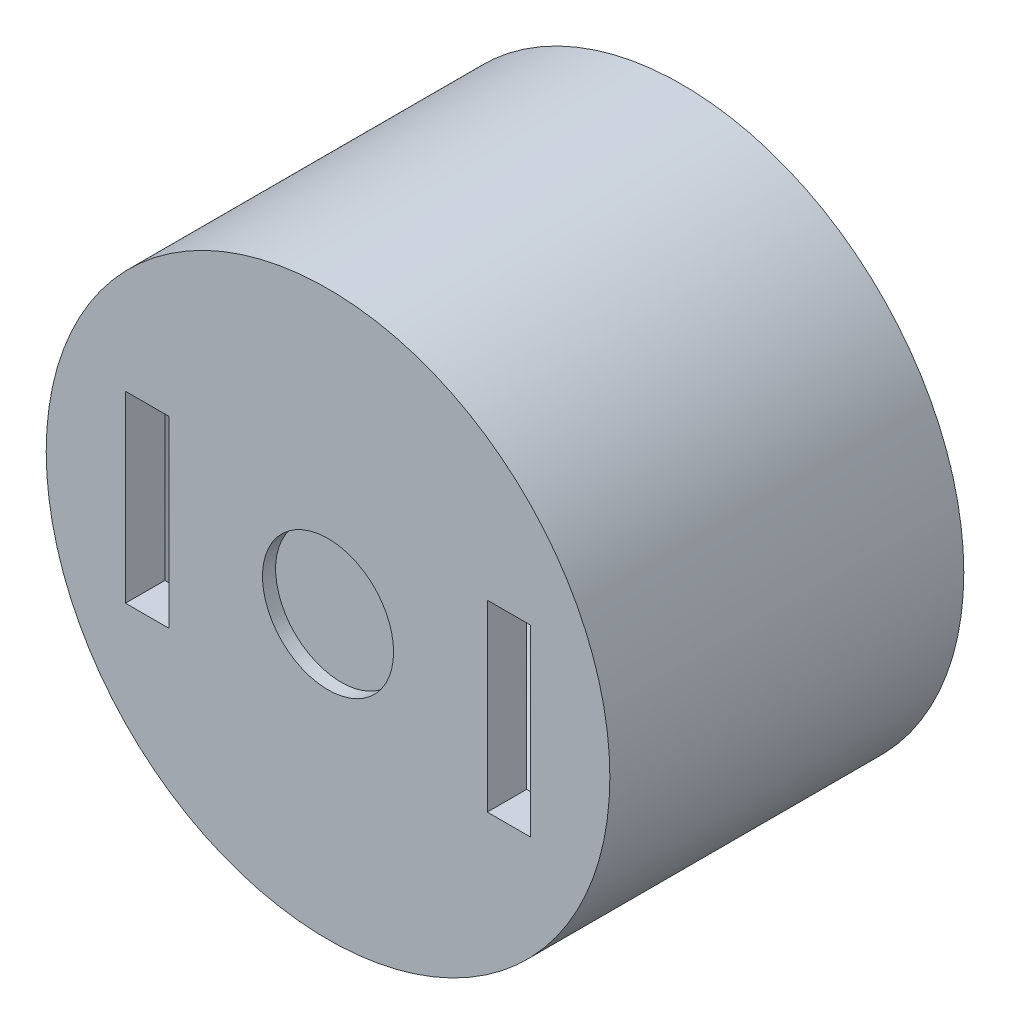
ISO-10303-21;
HEADER;
FILE_DESCRIPTION(('STEP AP214'),'2;1');
FILE_NAME('part.step','',(''),(''),'','','');
FILE_SCHEMA(('AUTOMOTIVE_DESIGN { 1 0 10303 214 1 1 1 1 }'));
ENDSEC;
DATA;
#1=APPLICATION_CONTEXT('core data for automotive mechanical design processes');
#2=APPLICATION_PROTOCOL_DEFINITION('international standard','automotive_design',2000,#1);
#3=PRODUCT_CONTEXT('',#1,'mechanical');
#4=PRODUCT('Part','Part','',(#3));
#5=PRODUCT_RELATED_PRODUCT_CATEGORY('part','',(#4));
#6=PRODUCT_DEFINITION_FORMATION('','',#4);
#7=PRODUCT_DEFINITION_CONTEXT('part definition',#1,'design');
#8=PRODUCT_DEFINITION('design','',#6,#7);
#9=PRODUCT_DEFINITION_SHAPE('','',#8);
#10=(LENGTH_UNIT() NAMED_UNIT(*) SI_UNIT(.MILLI.,.METRE.));
#11=(NAMED_UNIT(*) PLANE_ANGLE_UNIT() SI_UNIT($,.RADIAN.));
#12=(NAMED_UNIT(*) SI_UNIT($,.STERADIAN.) SOLID_ANGLE_UNIT());
#13=UNCERTAINTY_MEASURE_WITH_UNIT(LENGTH_MEASURE(1.E-05),#10,'distance_accuracy_value','');
#14=(GEOMETRIC_REPRESENTATION_CONTEXT(3) GLOBAL_UNCERTAINTY_ASSIGNED_CONTEXT((#13)) GLOBAL_UNIT_ASSIGNED_CONTEXT((#10,
#11,#12)) REPRESENTATION_CONTEXT('',''));
#15=CARTESIAN_POINT('',(0.,0.,0.));
#16=DIRECTION('',(0.,0.,1.));
#17=DIRECTION('',(1.,0.,0.));
#18=AXIS2_PLACEMENT_3D('',#15,#16,#17);
#19=CARTESIAN_POINT('',(0.,0.,27.));
#20=DIRECTION('',(0.,0.,1.));
#21=DIRECTION('',(1.,0.,0.));
#22=AXIS2_PLACEMENT_3D('',#19,#20,#21);
#23=PLANE('',#22);
#24=CARTESIAN_POINT('',(0.,0.,27.));
#25=DIRECTION('',(0.,0.,1.));
#26=DIRECTION('',(1.,0.,0.));
#27=AXIS2_PLACEMENT_3D('',#24,#25,#26);
#28=CIRCLE('',#27,5.);
#29=CARTESIAN_POINT('',(5.,0.,27.));
#30=VERTEX_POINT('',#29);
#31=EDGE_CURVE('E257',#30,#30,#28,.T.);
#32=ORIENTED_EDGE('',*,*,#31,.F.);
#33=EDGE_LOOP('',(#32));
#34=FACE_BOUND('',#33,.T.);
#35=CARTESIAN_POINT('',(0.,0.,27.));
#36=DIRECTION('',(0.,0.,1.));
#37=DIRECTION('',(1.,0.,0.));
#38=AXIS2_PLACEMENT_3D('',#35,#36,#37);
#39=CIRCLE('',#38,21.5);
#40=CARTESIAN_POINT('',(21.5,0.,27.));
#41=VERTEX_POINT('',#40);
#42=EDGE_CURVE('E147',#41,#41,#39,.T.);
#43=ORIENTED_EDGE('',*,*,#42,.T.);
#44=EDGE_LOOP('',(#43));
#45=FACE_BOUND('',#44,.T.);
#46=DIRECTION('',(1.,0.,0.));
#47=VECTOR('',#46,1.);
#48=CARTESIAN_POINT('',(0.,7.00000000000001,27.));
#49=LINE('',#48,#47);
#50=CARTESIAN_POINT('',(-15.45,7.,27.));
#51=VERTEX_POINT('',#50);
#52=CARTESIAN_POINT('',(-12.15,7.,27.));
#53=VERTEX_POINT('',#52);
#54=EDGE_CURVE('E123',#51,#53,#49,.T.);
#55=ORIENTED_EDGE('',*,*,#54,.T.);
#56=DIRECTION('',(0.,-1.,0.));
#57=VECTOR('',#56,1.);
#58=CARTESIAN_POINT('',(-12.15,0.,27.));
#59=LINE('',#58,#57);
#60=CARTESIAN_POINT('',(-12.15,-7.,27.));
#61=VERTEX_POINT('',#60);
#62=EDGE_CURVE('E114',#53,#61,#59,.T.);
#63=ORIENTED_EDGE('',*,*,#62,.T.);
#64=DIRECTION('',(-1.,0.,0.));
#65=VECTOR('',#64,1.);
#66=CARTESIAN_POINT('',(0.,-7.,27.));
#67=LINE('',#66,#65);
#68=CARTESIAN_POINT('',(-15.45,-7.,27.));
#69=VERTEX_POINT('',#68);
#70=EDGE_CURVE('E100',#61,#69,#67,.T.);
#71=ORIENTED_EDGE('',*,*,#70,.T.);
#72=DIRECTION('',(0.,1.,0.));
#73=VECTOR('',#72,1.);
#74=CARTESIAN_POINT('',(-15.45,0.,27.));
#75=LINE('',#74,#73);
#76=EDGE_CURVE('E108',#69,#51,#75,.T.);
#77=ORIENTED_EDGE('',*,*,#76,.T.);
#78=EDGE_LOOP('',(#55,#63,#71,#77));
#79=FACE_BOUND('',#78,.T.);
#80=DIRECTION('',(-1.,0.,0.));
#81=VECTOR('',#80,1.);
#82=CARTESIAN_POINT('',(0.,-7.00000000000001,27.));
#83=LINE('',#82,#81);
#84=CARTESIAN_POINT('',(15.45,-7.,27.));
#85=VERTEX_POINT('',#84);
#86=CARTESIAN_POINT('',(12.15,-7.,27.));
#87=VERTEX_POINT('',#86);
#88=EDGE_CURVE('E134',#85,#87,#83,.T.);
#89=ORIENTED_EDGE('',*,*,#88,.T.);
#90=DIRECTION('',(0.,1.,0.));
#91=VECTOR('',#90,1.);
#92=CARTESIAN_POINT('',(12.15,0.,27.));
#93=LINE('',#92,#91);
#94=CARTESIAN_POINT('',(12.15,7.,27.));
#95=VERTEX_POINT('',#94);
#96=EDGE_CURVE('E137',#87,#95,#93,.T.);
#97=ORIENTED_EDGE('',*,*,#96,.T.);
#98=DIRECTION('',(1.,0.,0.));
#99=VECTOR('',#98,1.);
#100=CARTESIAN_POINT('',(0.,7.00000000000001,27.));
#101=LINE('',#100,#99);
#102=CARTESIAN_POINT('',(15.45,7.,27.));
#103=VERTEX_POINT('',#102);
#104=EDGE_CURVE('E124',#95,#103,#101,.T.);
#105=ORIENTED_EDGE('',*,*,#104,.T.);
#106=DIRECTION('',(0.,-1.,0.));
#107=VECTOR('',#106,1.);
#108=CARTESIAN_POINT('',(15.45,0.,27.));
#109=LINE('',#108,#107);
#110=EDGE_CURVE('E127',#103,#85,#109,.T.);
#111=ORIENTED_EDGE('',*,*,#110,.T.);
#112=EDGE_LOOP('',(#89,#97,#105,#111));
#113=FACE_BOUND('',#112,.T.);
#114=ADVANCED_FACE('F37',(#34,#45,#79,#113),#23,.T.);
#115=CARTESIAN_POINT('',(0.,0.,24.));
#116=DIRECTION('',(0.,0.,1.));
#117=DIRECTION('',(1.,0.,0.));
#118=AXIS2_PLACEMENT_3D('',#115,#116,#117);
#119=PLANE('',#118);
#120=DIRECTION('',(0.,-1.,0.));
#121=VECTOR('',#120,1.);
#122=CARTESIAN_POINT('',(-12.15,0.,24.));
#123=LINE('',#122,#121);
#124=CARTESIAN_POINT('',(-12.15,7.,24.));
#125=VERTEX_POINT('',#124);
#126=CARTESIAN_POINT('',(-12.15,-7.,24.));
#127=VERTEX_POINT('',#126);
#128=EDGE_CURVE('E117',#125,#127,#123,.T.);
#129=ORIENTED_EDGE('',*,*,#128,.F.);
#130=DIRECTION('',(1.,0.,0.));
#131=VECTOR('',#130,1.);
#132=CARTESIAN_POINT('',(0.,7.00000000000001,24.));
#133=LINE('',#132,#131);
#134=CARTESIAN_POINT('',(-15.45,7.,24.));
#135=VERTEX_POINT('',#134);
#136=EDGE_CURVE('E156',#135,#125,#133,.T.);
#137=ORIENTED_EDGE('',*,*,#136,.F.);
#138=DIRECTION('',(0.,1.,0.));
#139=VECTOR('',#138,1.);
#140=CARTESIAN_POINT('',(-15.45,0.,24.));
#141=LINE('',#140,#139);
#142=CARTESIAN_POINT('',(-15.45,-7.,24.));
#143=VERTEX_POINT('',#142);
#144=EDGE_CURVE('E154',#143,#135,#141,.T.);
#145=ORIENTED_EDGE('',*,*,#144,.F.);
#146=DIRECTION('',(-1.,0.,0.));
#147=VECTOR('',#146,1.);
#148=CARTESIAN_POINT('',(0.,-7.,24.));
#149=LINE('',#148,#147);
#150=EDGE_CURVE('E150',#127,#143,#149,.T.);
#151=ORIENTED_EDGE('',*,*,#150,.F.);
#152=EDGE_LOOP('',(#129,#137,#145,#151));
#153=FACE_BOUND('',#152,.T.);
#154=CARTESIAN_POINT('',(0.,0.,24.));
#155=DIRECTION('',(0.,0.,1.));
#156=DIRECTION('',(1.,0.,0.));
#157=AXIS2_PLACEMENT_3D('',#154,#155,#156);
#158=CIRCLE('',#157,18.75);
#159=CARTESIAN_POINT('',(18.75,0.,24.));
#160=VERTEX_POINT('',#159);
#161=EDGE_CURVE('E141',#160,#160,#158,.T.);
#162=ORIENTED_EDGE('',*,*,#161,.F.);
#163=EDGE_LOOP('',(#162));
#164=FACE_BOUND('',#163,.T.);
#165=DIRECTION('',(0.,1.,0.));
#166=VECTOR('',#165,1.);
#167=CARTESIAN_POINT('',(12.15,0.,24.));
#168=LINE('',#167,#166);
#169=CARTESIAN_POINT('',(12.15,-7.,24.));
#170=VERTEX_POINT('',#169);
#171=CARTESIAN_POINT('',(12.15,7.,24.));
#172=VERTEX_POINT('',#171);
#173=EDGE_CURVE('E11',#170,#172,#168,.T.);
#174=ORIENTED_EDGE('',*,*,#173,.F.);
#175=DIRECTION('',(-1.,0.,0.));
#176=VECTOR('',#175,1.);
#177=CARTESIAN_POINT('',(0.,-7.00000000000001,24.));
#178=LINE('',#177,#176);
#179=CARTESIAN_POINT('',(15.45,-7.,24.));
#180=VERTEX_POINT('',#179);
#181=EDGE_CURVE('E45',#180,#170,#178,.T.);
#182=ORIENTED_EDGE('',*,*,#181,.F.);
#183=DIRECTION('',(0.,-1.,0.));
#184=VECTOR('',#183,1.);
#185=CARTESIAN_POINT('',(15.45,0.,24.));
#186=LINE('',#185,#184);
#187=CARTESIAN_POINT('',(15.45,7.,24.));
#188=VERTEX_POINT('',#187);
#189=EDGE_CURVE('E161',#188,#180,#186,.T.);
#190=ORIENTED_EDGE('',*,*,#189,.F.);
#191=DIRECTION('',(1.,0.,0.));
#192=VECTOR('',#191,1.);
#193=CARTESIAN_POINT('',(0.,7.00000000000001,24.));
#194=LINE('',#193,#192);
#195=EDGE_CURVE('E159',#172,#188,#194,.T.);
#196=ORIENTED_EDGE('',*,*,#195,.F.);
#197=EDGE_LOOP('',(#174,#182,#190,#196));
#198=FACE_BOUND('',#197,.T.);
#199=ADVANCED_FACE('F178',(#153,#164,#198),#119,.F.);
#200=CARTESIAN_POINT('',(0.,0.,27.));
#201=DIRECTION('',(0.,0.,-1.));
#202=DIRECTION('',(-1.,0.,0.));
#203=AXIS2_PLACEMENT_3D('',#200,#201,#202);
#204=CYLINDRICAL_SURFACE('',#203,21.5);
#205=ORIENTED_EDGE('',*,*,#42,.F.);
#206=EDGE_LOOP('',(#205));
#207=FACE_BOUND('',#206,.T.);
#208=CARTESIAN_POINT('',(0.,0.,0.));
#209=DIRECTION('',(0.,0.,1.));
#210=DIRECTION('',(1.,0.,0.));
#211=AXIS2_PLACEMENT_3D('',#208,#209,#210);
#212=CIRCLE('',#211,21.5);
#213=CARTESIAN_POINT('',(21.5,0.,0.));
#214=VERTEX_POINT('',#213);
#215=EDGE_CURVE('E144',#214,#214,#212,.T.);
#216=ORIENTED_EDGE('',*,*,#215,.T.);
#217=EDGE_LOOP('',(#216));
#218=FACE_BOUND('',#217,.T.);
#219=ADVANCED_FACE('F39',(#207,#218),#204,.T.);
#220=CARTESIAN_POINT('',(0.,0.,0.));
#221=DIRECTION('',(0.,0.,1.));
#222=DIRECTION('',(1.,0.,0.));
#223=AXIS2_PLACEMENT_3D('',#220,#221,#222);
#224=PLANE('',#223);
#225=CARTESIAN_POINT('',(0.,0.,0.));
#226=DIRECTION('',(0.,0.,1.));
#227=DIRECTION('',(1.,0.,0.));
#228=AXIS2_PLACEMENT_3D('',#225,#226,#227);
#229=CIRCLE('',#228,18.75);
#230=CARTESIAN_POINT('',(18.75,0.,0.));
#231=VERTEX_POINT('',#230);
#232=EDGE_CURVE('E140',#231,#231,#229,.T.);
#233=ORIENTED_EDGE('',*,*,#232,.T.);
#234=EDGE_LOOP('',(#233));
#235=FACE_BOUND('',#234,.T.);
#236=ORIENTED_EDGE('',*,*,#215,.F.);
#237=EDGE_LOOP('',(#236));
#238=FACE_BOUND('',#237,.T.);
#239=ADVANCED_FACE('F209',(#235,#238),#224,.F.);
#240=CARTESIAN_POINT('',(0.,0.,24.));
#241=DIRECTION('',(0.,0.,-1.));
#242=DIRECTION('',(-1.,0.,0.));
#243=AXIS2_PLACEMENT_3D('',#240,#241,#242);
#244=CYLINDRICAL_SURFACE('',#243,18.75);
#245=ORIENTED_EDGE('',*,*,#161,.T.);
#246=EDGE_LOOP('',(#245));
#247=FACE_BOUND('',#246,.T.);
#248=ORIENTED_EDGE('',*,*,#232,.F.);
#249=EDGE_LOOP('',(#248));
#250=FACE_BOUND('',#249,.T.);
#251=ADVANCED_FACE('F206',(#247,#250),#244,.F.);
#252=CARTESIAN_POINT('',(-12.15,7.,32.));
#253=DIRECTION('',(-1.,0.,0.));
#254=DIRECTION('',(0.,-1.,0.));
#255=AXIS2_PLACEMENT_3D('',#252,#253,#254);
#256=PLANE('',#255);
#257=DIRECTION('',(0.,0.,-1.));
#258=VECTOR('',#257,1.);
#259=CARTESIAN_POINT('',(-12.15,7.,32.));
#260=LINE('',#259,#258);
#261=EDGE_CURVE('E185',#53,#125,#260,.T.);
#262=ORIENTED_EDGE('',*,*,#261,.T.);
#263=ORIENTED_EDGE('',*,*,#128,.T.);
#264=DIRECTION('',(0.,0.,-1.));
#265=VECTOR('',#264,1.);
#266=CARTESIAN_POINT('',(-12.15,-7.,32.));
#267=LINE('',#266,#265);
#268=EDGE_CURVE('E103',#61,#127,#267,.T.);
#269=ORIENTED_EDGE('',*,*,#268,.F.);
#270=ORIENTED_EDGE('',*,*,#62,.F.);
#271=EDGE_LOOP('',(#262,#263,#269,#270));
#272=FACE_BOUND('',#271,.T.);
#273=ADVANCED_FACE('F113',(#272),#256,.T.);
#274=CARTESIAN_POINT('',(-15.45,7.,32.));
#275=DIRECTION('',(0.,-1.,0.));
#276=DIRECTION('',(1.,0.,0.));
#277=AXIS2_PLACEMENT_3D('',#274,#275,#276);
#278=PLANE('',#277);
#279=DIRECTION('',(0.,0.,-1.));
#280=VECTOR('',#279,1.);
#281=CARTESIAN_POINT('',(-15.45,7.,32.));
#282=LINE('',#281,#280);
#283=EDGE_CURVE('E190',#51,#135,#282,.T.);
#284=ORIENTED_EDGE('',*,*,#283,.T.);
#285=ORIENTED_EDGE('',*,*,#136,.T.);
#286=ORIENTED_EDGE('',*,*,#261,.F.);
#287=ORIENTED_EDGE('',*,*,#54,.F.);
#288=EDGE_LOOP('',(#284,#285,#286,#287));
#289=FACE_BOUND('',#288,.T.);
#290=ADVANCED_FACE('F199',(#289),#278,.T.);
#291=CARTESIAN_POINT('',(-15.45,7.,32.));
#292=DIRECTION('',(1.,0.,0.));
#293=DIRECTION('',(0.,1.,0.));
#294=AXIS2_PLACEMENT_3D('',#291,#292,#293);
#295=PLANE('',#294);
#296=DIRECTION('',(0.,0.,-1.));
#297=VECTOR('',#296,1.);
#298=CARTESIAN_POINT('',(-15.45,-7.,32.));
#299=LINE('',#298,#297);
#300=EDGE_CURVE('E60',#69,#143,#299,.T.);
#301=ORIENTED_EDGE('',*,*,#300,.T.);
#302=ORIENTED_EDGE('',*,*,#144,.T.);
#303=ORIENTED_EDGE('',*,*,#283,.F.);
#304=ORIENTED_EDGE('',*,*,#76,.F.);
#305=EDGE_LOOP('',(#301,#302,#303,#304));
#306=FACE_BOUND('',#305,.T.);
#307=ADVANCED_FACE('F195',(#306),#295,.T.);
#308=CARTESIAN_POINT('',(-15.45,-7.,32.));
#309=DIRECTION('',(0.,1.,0.));
#310=DIRECTION('',(-1.,0.,0.));
#311=AXIS2_PLACEMENT_3D('',#308,#309,#310);
#312=PLANE('',#311);
#313=ORIENTED_EDGE('',*,*,#268,.T.);
#314=ORIENTED_EDGE('',*,*,#150,.T.);
#315=ORIENTED_EDGE('',*,*,#300,.F.);
#316=ORIENTED_EDGE('',*,*,#70,.F.);
#317=EDGE_LOOP('',(#313,#314,#315,#316));
#318=FACE_BOUND('',#317,.T.);
#319=ADVANCED_FACE('F102',(#318),#312,.T.);
#320=CARTESIAN_POINT('',(12.15,7.,32.));
#321=DIRECTION('',(1.,0.,0.));
#322=DIRECTION('',(0.,0.,-1.));
#323=AXIS2_PLACEMENT_3D('',#320,#321,#322);
#324=PLANE('',#323);
#325=DIRECTION('',(0.,0.,-1.));
#326=VECTOR('',#325,1.);
#327=CARTESIAN_POINT('',(12.15,-7.,32.));
#328=LINE('',#327,#326);
#329=EDGE_CURVE('E109',#87,#170,#328,.T.);
#330=ORIENTED_EDGE('',*,*,#329,.T.);
#331=ORIENTED_EDGE('',*,*,#173,.T.);
#332=DIRECTION('',(0.,0.,-1.));
#333=VECTOR('',#332,1.);
#334=CARTESIAN_POINT('',(12.15,7.,32.));
#335=LINE('',#334,#333);
#336=EDGE_CURVE('E180',#95,#172,#335,.T.);
#337=ORIENTED_EDGE('',*,*,#336,.F.);
#338=ORIENTED_EDGE('',*,*,#96,.F.);
#339=EDGE_LOOP('',(#330,#331,#337,#338));
#340=FACE_BOUND('',#339,.T.);
#341=ADVANCED_FACE('F174',(#340),#324,.T.);
#342=CARTESIAN_POINT('',(15.45,-7.,32.));
#343=DIRECTION('',(0.,1.,0.));
#344=DIRECTION('',(-1.,0.,0.));
#345=AXIS2_PLACEMENT_3D('',#342,#343,#344);
#346=PLANE('',#345);
#347=DIRECTION('',(0.,0.,-1.));
#348=VECTOR('',#347,1.);
#349=CARTESIAN_POINT('',(15.45,-7.,32.));
#350=LINE('',#349,#348);
#351=EDGE_CURVE('E169',#85,#180,#350,.T.);
#352=ORIENTED_EDGE('',*,*,#351,.T.);
#353=ORIENTED_EDGE('',*,*,#181,.T.);
#354=ORIENTED_EDGE('',*,*,#329,.F.);
#355=ORIENTED_EDGE('',*,*,#88,.F.);
#356=EDGE_LOOP('',(#352,#353,#354,#355));
#357=FACE_BOUND('',#356,.T.);
#358=ADVANCED_FACE('F167',(#357),#346,.T.);
#359=CARTESIAN_POINT('',(15.45,7.,32.));
#360=DIRECTION('',(-1.,0.,0.));
#361=DIRECTION('',(0.,0.,1.));
#362=AXIS2_PLACEMENT_3D('',#359,#360,#361);
#363=PLANE('',#362);
#364=DIRECTION('',(0.,0.,-1.));
#365=VECTOR('',#364,1.);
#366=CARTESIAN_POINT('',(15.45,7.,32.));
#367=LINE('',#366,#365);
#368=EDGE_CURVE('E52',#103,#188,#367,.T.);
#369=ORIENTED_EDGE('',*,*,#368,.T.);
#370=ORIENTED_EDGE('',*,*,#189,.T.);
#371=ORIENTED_EDGE('',*,*,#351,.F.);
#372=ORIENTED_EDGE('',*,*,#110,.F.);
#373=EDGE_LOOP('',(#369,#370,#371,#372));
#374=FACE_BOUND('',#373,.T.);
#375=ADVANCED_FACE('F182',(#374),#363,.T.);
#376=CARTESIAN_POINT('',(15.45,7.,32.));
#377=DIRECTION('',(0.,-1.,0.));
#378=DIRECTION('',(1.,0.,0.));
#379=AXIS2_PLACEMENT_3D('',#376,#377,#378);
#380=PLANE('',#379);
#381=ORIENTED_EDGE('',*,*,#336,.T.);
#382=ORIENTED_EDGE('',*,*,#195,.T.);
#383=ORIENTED_EDGE('',*,*,#368,.F.);
#384=ORIENTED_EDGE('',*,*,#104,.F.);
#385=EDGE_LOOP('',(#381,#382,#383,#384));
#386=FACE_BOUND('',#385,.T.);
#387=ADVANCED_FACE('F179',(#386),#380,.T.);
#388=CARTESIAN_POINT('',(0.,0.,26.));
#389=DIRECTION('',(0.,0.,1.));
#390=DIRECTION('',(1.,0.,0.));
#391=AXIS2_PLACEMENT_3D('',#388,#389,#390);
#392=CYLINDRICAL_SURFACE('',#391,5.);
#393=CARTESIAN_POINT('',(0.,0.,26.));
#394=DIRECTION('',(0.,0.,1.));
#395=DIRECTION('',(1.,0.,0.));
#396=AXIS2_PLACEMENT_3D('',#393,#394,#395);
#397=CIRCLE('',#396,5.);
#398=CARTESIAN_POINT('',(5.,0.,26.));
#399=VERTEX_POINT('',#398);
#400=EDGE_CURVE('E119',#399,#399,#397,.T.);
#401=ORIENTED_EDGE('',*,*,#400,.F.);
#402=EDGE_LOOP('',(#401));
#403=FACE_BOUND('',#402,.T.);
#404=ORIENTED_EDGE('',*,*,#31,.T.);
#405=EDGE_LOOP('',(#404));
#406=FACE_BOUND('',#405,.T.);
#407=ADVANCED_FACE('F246',(#403,#406),#392,.F.);
#408=CARTESIAN_POINT('',(0.,0.,26.));
#409=DIRECTION('',(0.,0.,1.));
#410=DIRECTION('',(1.,0.,0.));
#411=AXIS2_PLACEMENT_3D('',#408,#409,#410);
#412=PLANE('',#411);
#413=ORIENTED_EDGE('',*,*,#400,.T.);
#414=EDGE_LOOP('',(#413));
#415=FACE_BOUND('',#414,.T.);
#416=ADVANCED_FACE('F249',(#415),#412,.T.);
#417=CLOSED_SHELL('',(#114,#199,#219,#239,#251,#273,#290,#307,#319,#341,#358,#375,#387,#407,#416));
#418=MANIFOLD_SOLID_BREP('B2',#417);
#419=ADVANCED_BREP_SHAPE_REPRESENTATION('',(#18,#418),#14);
#420=SHAPE_DEFINITION_REPRESENTATION(#9,#419);
ENDSEC;
END-ISO-10303-21;
